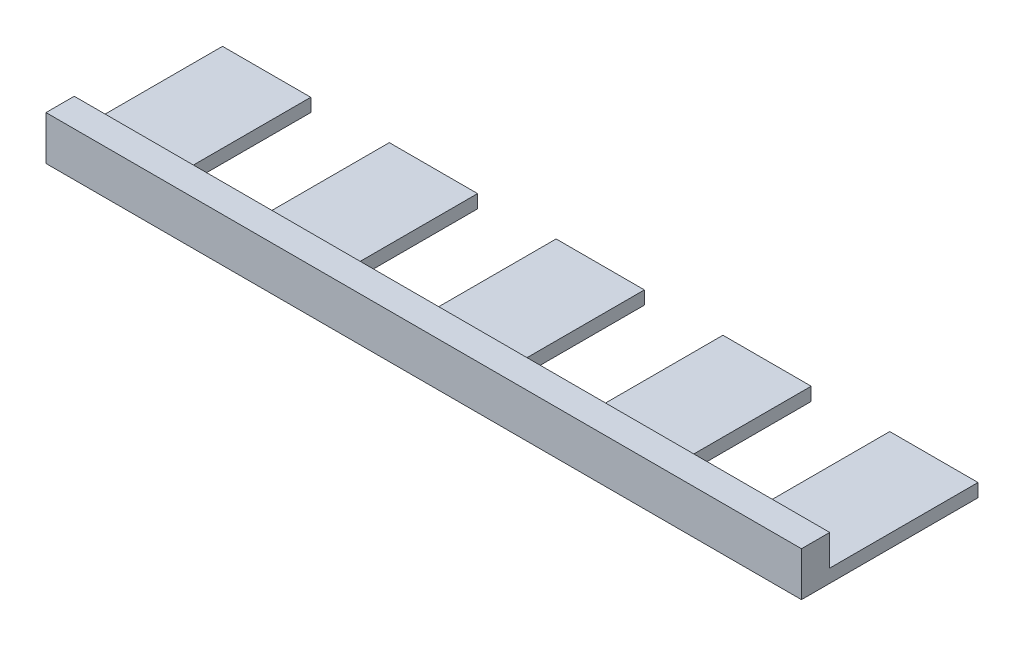
ISO-10303-21;
HEADER;
FILE_DESCRIPTION(('STEP AP214'),'2;1');
FILE_NAME('part.step','',(''),(''),'','','');
FILE_SCHEMA(('AUTOMOTIVE_DESIGN { 1 0 10303 214 1 1 1 1 }'));
ENDSEC;
DATA;
#1=APPLICATION_CONTEXT('core data for automotive mechanical design processes');
#2=APPLICATION_PROTOCOL_DEFINITION('international standard','automotive_design',2000,#1);
#3=PRODUCT_CONTEXT('',#1,'mechanical');
#4=PRODUCT('Part','Part','',(#3));
#5=PRODUCT_RELATED_PRODUCT_CATEGORY('part','',(#4));
#6=PRODUCT_DEFINITION_FORMATION('','',#4);
#7=PRODUCT_DEFINITION_CONTEXT('part definition',#1,'design');
#8=PRODUCT_DEFINITION('design','',#6,#7);
#9=PRODUCT_DEFINITION_SHAPE('','',#8);
#10=(LENGTH_UNIT() NAMED_UNIT(*) SI_UNIT(.MILLI.,.METRE.));
#11=(NAMED_UNIT(*) PLANE_ANGLE_UNIT() SI_UNIT($,.RADIAN.));
#12=(NAMED_UNIT(*) SI_UNIT($,.STERADIAN.) SOLID_ANGLE_UNIT());
#13=UNCERTAINTY_MEASURE_WITH_UNIT(LENGTH_MEASURE(1.E-05),#10,'distance_accuracy_value','');
#14=(GEOMETRIC_REPRESENTATION_CONTEXT(3) GLOBAL_UNCERTAINTY_ASSIGNED_CONTEXT((#13)) GLOBAL_UNIT_ASSIGNED_CONTEXT((#10,
#11,#12)) REPRESENTATION_CONTEXT('',''));
#15=CARTESIAN_POINT('',(0.,0.,0.));
#16=DIRECTION('',(0.,0.,1.));
#17=DIRECTION('',(1.,0.,0.));
#18=AXIS2_PLACEMENT_3D('',#15,#16,#17);
#19=CARTESIAN_POINT('',(0.,3.,0.));
#20=DIRECTION('',(0.,1.,0.));
#21=DIRECTION('',(0.,0.,1.));
#22=AXIS2_PLACEMENT_3D('',#19,#20,#21);
#23=PLANE('',#22);
#24=DIRECTION('',(-1.,0.,0.));
#25=VECTOR('',#24,1.);
#26=CARTESIAN_POINT('',(0.,3.,-6.39999999999999));
#27=LINE('',#26,#25);
#28=CARTESIAN_POINT('',(171.2,3.,-6.39999999999999));
#29=VERTEX_POINT('',#28);
#30=CARTESIAN_POINT('',(151.2,3.,-6.40000000000001));
#31=VERTEX_POINT('',#30);
#32=EDGE_CURVE('E47',#29,#31,#27,.T.);
#33=ORIENTED_EDGE('',*,*,#32,.F.);
#34=DIRECTION('',(0.,0.,-1.));
#35=VECTOR('',#34,1.);
#36=CARTESIAN_POINT('',(171.2,3.,0.));
#37=LINE('',#36,#35);
#38=CARTESIAN_POINT('',(171.2,3.,-40.));
#39=VERTEX_POINT('',#38);
#40=EDGE_CURVE('E134',#29,#39,#37,.T.);
#41=ORIENTED_EDGE('',*,*,#40,.T.);
#42=DIRECTION('',(-1.,0.,0.));
#43=VECTOR('',#42,1.);
#44=CARTESIAN_POINT('',(0.,3.,-40.));
#45=LINE('',#44,#43);
#46=CARTESIAN_POINT('',(151.2,3.,-40.));
#47=VERTEX_POINT('',#46);
#48=EDGE_CURVE('E402',#39,#47,#45,.T.);
#49=ORIENTED_EDGE('',*,*,#48,.T.);
#50=DIRECTION('',(0.,0.,1.));
#51=VECTOR('',#50,1.);
#52=CARTESIAN_POINT('',(151.2,3.,0.));
#53=LINE('',#52,#51);
#54=EDGE_CURVE('E424',#47,#31,#53,.T.);
#55=ORIENTED_EDGE('',*,*,#54,.T.);
#56=EDGE_LOOP('',(#33,#41,#49,#55));
#57=FACE_BOUND('',#56,.T.);
#58=ADVANCED_FACE('F36',(#57),#23,.T.);
#59=CARTESIAN_POINT('',(133.4,3.,-6.40000000000001));
#60=VERTEX_POINT('',#59);
#61=CARTESIAN_POINT('',(113.4,3.,-6.4));
#62=VERTEX_POINT('',#61);
#63=EDGE_CURVE('E11',#60,#62,#27,.T.);
#64=ORIENTED_EDGE('',*,*,#63,.F.);
#65=DIRECTION('',(0.,0.,-1.));
#66=VECTOR('',#65,1.);
#67=CARTESIAN_POINT('',(133.4,3.,0.));
#68=LINE('',#67,#66);
#69=CARTESIAN_POINT('',(133.4,3.,-40.));
#70=VERTEX_POINT('',#69);
#71=EDGE_CURVE('E426',#60,#70,#68,.T.);
#72=ORIENTED_EDGE('',*,*,#71,.T.);
#73=DIRECTION('',(-1.,0.,0.));
#74=VECTOR('',#73,1.);
#75=CARTESIAN_POINT('',(0.,3.,-40.));
#76=LINE('',#75,#74);
#77=CARTESIAN_POINT('',(113.4,3.,-40.));
#78=VERTEX_POINT('',#77);
#79=EDGE_CURVE('E428',#70,#78,#76,.T.);
#80=ORIENTED_EDGE('',*,*,#79,.T.);
#81=DIRECTION('',(0.,0.,1.));
#82=VECTOR('',#81,1.);
#83=CARTESIAN_POINT('',(113.4,3.,0.));
#84=LINE('',#83,#82);
#85=EDGE_CURVE('E430',#78,#62,#84,.T.);
#86=ORIENTED_EDGE('',*,*,#85,.T.);
#87=EDGE_LOOP('',(#64,#72,#80,#86));
#88=FACE_BOUND('',#87,.T.);
#89=ADVANCED_FACE('F330',(#88),#23,.T.);
#90=CARTESIAN_POINT('',(95.6,3.,-6.4));
#91=VERTEX_POINT('',#90);
#92=CARTESIAN_POINT('',(75.6,3.,-6.4));
#93=VERTEX_POINT('',#92);
#94=EDGE_CURVE('E45',#91,#93,#27,.T.);
#95=ORIENTED_EDGE('',*,*,#94,.F.);
#96=DIRECTION('',(0.,0.,-1.));
#97=VECTOR('',#96,1.);
#98=CARTESIAN_POINT('',(95.6,3.,0.));
#99=LINE('',#98,#97);
#100=CARTESIAN_POINT('',(95.6,3.,-40.));
#101=VERTEX_POINT('',#100);
#102=EDGE_CURVE('E432',#91,#101,#99,.T.);
#103=ORIENTED_EDGE('',*,*,#102,.T.);
#104=DIRECTION('',(1.,0.,0.));
#105=VECTOR('',#104,1.);
#106=CARTESIAN_POINT('',(0.,3.,-40.));
#107=LINE('',#106,#105);
#108=CARTESIAN_POINT('',(75.6,3.,-40.));
#109=VERTEX_POINT('',#108);
#110=EDGE_CURVE('E434',#109,#101,#107,.T.);
#111=ORIENTED_EDGE('',*,*,#110,.F.);
#112=DIRECTION('',(0.,0.,-1.));
#113=VECTOR('',#112,1.);
#114=CARTESIAN_POINT('',(75.6,3.,0.));
#115=LINE('',#114,#113);
#116=EDGE_CURVE('E437',#93,#109,#115,.T.);
#117=ORIENTED_EDGE('',*,*,#116,.F.);
#118=EDGE_LOOP('',(#95,#103,#111,#117));
#119=FACE_BOUND('',#118,.T.);
#120=ADVANCED_FACE('F326',(#119),#23,.T.);
#121=CARTESIAN_POINT('',(57.8,3.,-6.4));
#122=VERTEX_POINT('',#121);
#123=CARTESIAN_POINT('',(37.8,3.,-6.4));
#124=VERTEX_POINT('',#123);
#125=EDGE_CURVE('E191',#122,#124,#27,.T.);
#126=ORIENTED_EDGE('',*,*,#125,.F.);
#127=DIRECTION('',(0.,0.,1.));
#128=VECTOR('',#127,1.);
#129=CARTESIAN_POINT('',(57.8,3.,0.));
#130=LINE('',#129,#128);
#131=CARTESIAN_POINT('',(57.8,3.,-40.));
#132=VERTEX_POINT('',#131);
#133=EDGE_CURVE('E440',#132,#122,#130,.T.);
#134=ORIENTED_EDGE('',*,*,#133,.F.);
#135=DIRECTION('',(1.,0.,0.));
#136=VECTOR('',#135,1.);
#137=CARTESIAN_POINT('',(0.,3.,-40.));
#138=LINE('',#137,#136);
#139=CARTESIAN_POINT('',(37.8,3.,-40.));
#140=VERTEX_POINT('',#139);
#141=EDGE_CURVE('E209',#140,#132,#138,.T.);
#142=ORIENTED_EDGE('',*,*,#141,.F.);
#143=DIRECTION('',(0.,0.,-1.));
#144=VECTOR('',#143,1.);
#145=CARTESIAN_POINT('',(37.8,3.,0.));
#146=LINE('',#145,#144);
#147=EDGE_CURVE('E205',#124,#140,#146,.T.);
#148=ORIENTED_EDGE('',*,*,#147,.F.);
#149=EDGE_LOOP('',(#126,#134,#142,#148));
#150=FACE_BOUND('',#149,.T.);
#151=ADVANCED_FACE('F320',(#150),#23,.T.);
#152=CARTESIAN_POINT('',(0.,3.,0.));
#153=DIRECTION('',(-1.,0.,0.));
#154=DIRECTION('',(0.,0.,1.));
#155=AXIS2_PLACEMENT_3D('',#152,#153,#154);
#156=PLANE('',#155);
#157=DIRECTION('',(0.,0.,-1.));
#158=VECTOR('',#157,1.);
#159=CARTESIAN_POINT('',(0.,0.,0.));
#160=LINE('',#159,#158);
#161=CARTESIAN_POINT('',(0.,0.,0.));
#162=VERTEX_POINT('',#161);
#163=CARTESIAN_POINT('',(0.,0.,-40.));
#164=VERTEX_POINT('',#163);
#165=EDGE_CURVE('E213',#162,#164,#160,.T.);
#166=ORIENTED_EDGE('',*,*,#165,.F.);
#167=DIRECTION('',(0.,-1.,0.));
#168=VECTOR('',#167,1.);
#169=CARTESIAN_POINT('',(0.,3.,0.));
#170=LINE('',#169,#168);
#171=CARTESIAN_POINT('',(0.,10.,0.));
#172=VERTEX_POINT('',#171);
#173=EDGE_CURVE('E40',#172,#162,#170,.T.);
#174=ORIENTED_EDGE('',*,*,#173,.F.);
#175=DIRECTION('',(0.,0.,1.));
#176=VECTOR('',#175,1.);
#177=CARTESIAN_POINT('',(0.,10.,-6.39999999999999));
#178=LINE('',#177,#176);
#179=CARTESIAN_POINT('',(0.,10.,-6.39999999999999));
#180=VERTEX_POINT('',#179);
#181=EDGE_CURVE('E412',#180,#172,#178,.T.);
#182=ORIENTED_EDGE('',*,*,#181,.F.);
#183=DIRECTION('',(0.,-1.,0.));
#184=VECTOR('',#183,1.);
#185=CARTESIAN_POINT('',(0.,10.,-6.39999999999999));
#186=LINE('',#185,#184);
#187=CARTESIAN_POINT('',(0.,3.,-6.39999999999999));
#188=VERTEX_POINT('',#187);
#189=EDGE_CURVE('E418',#180,#188,#186,.T.);
#190=ORIENTED_EDGE('',*,*,#189,.T.);
#191=DIRECTION('',(0.,0.,-1.));
#192=VECTOR('',#191,1.);
#193=CARTESIAN_POINT('',(0.,3.,0.));
#194=LINE('',#193,#192);
#195=CARTESIAN_POINT('',(0.,3.,-40.));
#196=VERTEX_POINT('',#195);
#197=EDGE_CURVE('E62',#188,#196,#194,.T.);
#198=ORIENTED_EDGE('',*,*,#197,.T.);
#199=DIRECTION('',(0.,-1.,0.));
#200=VECTOR('',#199,1.);
#201=CARTESIAN_POINT('',(0.,3.,-40.));
#202=LINE('',#201,#200);
#203=EDGE_CURVE('E129',#196,#164,#202,.T.);
#204=ORIENTED_EDGE('',*,*,#203,.T.);
#205=EDGE_LOOP('',(#166,#174,#182,#190,#198,#204));
#206=FACE_BOUND('',#205,.T.);
#207=ADVANCED_FACE('F38',(#206),#156,.T.);
#208=CARTESIAN_POINT('',(0.,3.,0.));
#209=DIRECTION('',(0.,0.,-1.));
#210=DIRECTION('',(-1.,0.,0.));
#211=AXIS2_PLACEMENT_3D('',#208,#209,#210);
#212=PLANE('',#211);
#213=DIRECTION('',(1.,0.,0.));
#214=VECTOR('',#213,1.);
#215=CARTESIAN_POINT('',(0.,0.,0.));
#216=LINE('',#215,#214);
#217=CARTESIAN_POINT('',(171.2,0.,0.));
#218=VERTEX_POINT('',#217);
#219=EDGE_CURVE('E215',#162,#218,#216,.T.);
#220=ORIENTED_EDGE('',*,*,#219,.T.);
#221=DIRECTION('',(0.,-1.,0.));
#222=VECTOR('',#221,1.);
#223=CARTESIAN_POINT('',(171.2,3.,0.));
#224=LINE('',#223,#222);
#225=CARTESIAN_POINT('',(171.2,10.,0.));
#226=VERTEX_POINT('',#225);
#227=EDGE_CURVE('E299',#226,#218,#224,.T.);
#228=ORIENTED_EDGE('',*,*,#227,.F.);
#229=DIRECTION('',(1.,0.,0.));
#230=VECTOR('',#229,1.);
#231=CARTESIAN_POINT('',(0.,10.,0.));
#232=LINE('',#231,#230);
#233=EDGE_CURVE('E312',#172,#226,#232,.T.);
#234=ORIENTED_EDGE('',*,*,#233,.F.);
#235=ORIENTED_EDGE('',*,*,#173,.T.);
#236=EDGE_LOOP('',(#220,#228,#234,#235));
#237=FACE_BOUND('',#236,.T.);
#238=ADVANCED_FACE('F309',(#237),#212,.F.);
#239=CARTESIAN_POINT('',(171.2,3.,0.));
#240=DIRECTION('',(-1.,0.,0.));
#241=DIRECTION('',(0.,0.,1.));
#242=AXIS2_PLACEMENT_3D('',#239,#240,#241);
#243=PLANE('',#242);
#244=DIRECTION('',(0.,0.,-1.));
#245=VECTOR('',#244,1.);
#246=CARTESIAN_POINT('',(171.2,0.,0.));
#247=LINE('',#246,#245);
#248=CARTESIAN_POINT('',(171.2,0.,-40.));
#249=VERTEX_POINT('',#248);
#250=EDGE_CURVE('E218',#218,#249,#247,.T.);
#251=ORIENTED_EDGE('',*,*,#250,.T.);
#252=DIRECTION('',(0.,-1.,0.));
#253=VECTOR('',#252,1.);
#254=CARTESIAN_POINT('',(171.2,3.,-40.));
#255=LINE('',#254,#253);
#256=EDGE_CURVE('E297',#39,#249,#255,.T.);
#257=ORIENTED_EDGE('',*,*,#256,.F.);
#258=ORIENTED_EDGE('',*,*,#40,.F.);
#259=DIRECTION('',(0.,-1.,0.));
#260=VECTOR('',#259,1.);
#261=CARTESIAN_POINT('',(171.2,10.,-6.39999999999999));
#262=LINE('',#261,#260);
#263=CARTESIAN_POINT('',(171.2,10.,-6.39999999999999));
#264=VERTEX_POINT('',#263);
#265=EDGE_CURVE('E216',#264,#29,#262,.T.);
#266=ORIENTED_EDGE('',*,*,#265,.F.);
#267=DIRECTION('',(0.,0.,-1.));
#268=VECTOR('',#267,1.);
#269=CARTESIAN_POINT('',(171.2,10.,-6.39999999999999));
#270=LINE('',#269,#268);
#271=EDGE_CURVE('E657',#226,#264,#270,.T.);
#272=ORIENTED_EDGE('',*,*,#271,.F.);
#273=ORIENTED_EDGE('',*,*,#227,.T.);
#274=EDGE_LOOP('',(#251,#257,#258,#266,#272,#273));
#275=FACE_BOUND('',#274,.T.);
#276=ADVANCED_FACE('F325',(#275),#243,.F.);
#277=CARTESIAN_POINT('',(0.,3.,-40.));
#278=DIRECTION('',(0.,0.,1.));
#279=DIRECTION('',(1.,0.,0.));
#280=AXIS2_PLACEMENT_3D('',#277,#278,#279);
#281=PLANE('',#280);
#282=DIRECTION('',(-1.,0.,0.));
#283=VECTOR('',#282,1.);
#284=CARTESIAN_POINT('',(0.,0.,-40.));
#285=LINE('',#284,#283);
#286=CARTESIAN_POINT('',(151.2,0.,-40.));
#287=VERTEX_POINT('',#286);
#288=EDGE_CURVE('E220',#249,#287,#285,.T.);
#289=ORIENTED_EDGE('',*,*,#288,.T.);
#290=DIRECTION('',(0.,-1.,0.));
#291=VECTOR('',#290,1.);
#292=CARTESIAN_POINT('',(151.2,3.,-40.));
#293=LINE('',#292,#291);
#294=EDGE_CURVE('E294',#47,#287,#293,.T.);
#295=ORIENTED_EDGE('',*,*,#294,.F.);
#296=ORIENTED_EDGE('',*,*,#48,.F.);
#297=ORIENTED_EDGE('',*,*,#256,.T.);
#298=EDGE_LOOP('',(#289,#295,#296,#297));
#299=FACE_BOUND('',#298,.T.);
#300=ADVANCED_FACE('F392',(#299),#281,.F.);
#301=CARTESIAN_POINT('',(151.2,3.,0.));
#302=DIRECTION('',(1.,0.,0.));
#303=DIRECTION('',(0.,0.,-1.));
#304=AXIS2_PLACEMENT_3D('',#301,#302,#303);
#305=PLANE('',#304);
#306=DIRECTION('',(0.,0.,1.));
#307=VECTOR('',#306,1.);
#308=CARTESIAN_POINT('',(151.2,0.,0.));
#309=LINE('',#308,#307);
#310=CARTESIAN_POINT('',(151.2,0.,-6.40000000000001));
#311=VERTEX_POINT('',#310);
#312=EDGE_CURVE('E222',#287,#311,#309,.T.);
#313=ORIENTED_EDGE('',*,*,#312,.T.);
#314=DIRECTION('',(0.,-1.,0.));
#315=VECTOR('',#314,1.);
#316=CARTESIAN_POINT('',(151.2,3.,-6.40000000000001));
#317=LINE('',#316,#315);
#318=EDGE_CURVE('E291',#31,#311,#317,.T.);
#319=ORIENTED_EDGE('',*,*,#318,.F.);
#320=ORIENTED_EDGE('',*,*,#54,.F.);
#321=ORIENTED_EDGE('',*,*,#294,.T.);
#322=EDGE_LOOP('',(#313,#319,#320,#321));
#323=FACE_BOUND('',#322,.T.);
#324=ADVANCED_FACE('F388',(#323),#305,.F.);
#325=CARTESIAN_POINT('',(133.4,3.,0.));
#326=DIRECTION('',(-1.,0.,0.));
#327=DIRECTION('',(0.,0.,1.));
#328=AXIS2_PLACEMENT_3D('',#325,#326,#327);
#329=PLANE('',#328);
#330=DIRECTION('',(0.,0.,-1.));
#331=VECTOR('',#330,1.);
#332=CARTESIAN_POINT('',(133.4,0.,0.));
#333=LINE('',#332,#331);
#334=CARTESIAN_POINT('',(133.4,0.,-6.40000000000001));
#335=VERTEX_POINT('',#334);
#336=CARTESIAN_POINT('',(133.4,0.,-40.));
#337=VERTEX_POINT('',#336);
#338=EDGE_CURVE('E226',#335,#337,#333,.T.);
#339=ORIENTED_EDGE('',*,*,#338,.T.);
#340=DIRECTION('',(0.,-1.,0.));
#341=VECTOR('',#340,1.);
#342=CARTESIAN_POINT('',(133.4,3.,-40.));
#343=LINE('',#342,#341);
#344=EDGE_CURVE('E285',#70,#337,#343,.T.);
#345=ORIENTED_EDGE('',*,*,#344,.F.);
#346=ORIENTED_EDGE('',*,*,#71,.F.);
#347=DIRECTION('',(0.,-1.,0.));
#348=VECTOR('',#347,1.);
#349=CARTESIAN_POINT('',(133.4,3.,-6.40000000000001));
#350=LINE('',#349,#348);
#351=EDGE_CURVE('E288',#60,#335,#350,.T.);
#352=ORIENTED_EDGE('',*,*,#351,.T.);
#353=EDGE_LOOP('',(#339,#345,#346,#352));
#354=FACE_BOUND('',#353,.T.);
#355=ADVANCED_FACE('F384',(#354),#329,.F.);
#356=CARTESIAN_POINT('',(0.,3.,-40.));
#357=DIRECTION('',(0.,0.,1.));
#358=DIRECTION('',(1.,0.,0.));
#359=AXIS2_PLACEMENT_3D('',#356,#357,#358);
#360=PLANE('',#359);
#361=DIRECTION('',(-1.,0.,0.));
#362=VECTOR('',#361,1.);
#363=CARTESIAN_POINT('',(0.,0.,-40.));
#364=LINE('',#363,#362);
#365=CARTESIAN_POINT('',(113.4,0.,-40.));
#366=VERTEX_POINT('',#365);
#367=EDGE_CURVE('E228',#337,#366,#364,.T.);
#368=ORIENTED_EDGE('',*,*,#367,.T.);
#369=DIRECTION('',(0.,-1.,0.));
#370=VECTOR('',#369,1.);
#371=CARTESIAN_POINT('',(113.4,3.,-40.));
#372=LINE('',#371,#370);
#373=EDGE_CURVE('E282',#78,#366,#372,.T.);
#374=ORIENTED_EDGE('',*,*,#373,.F.);
#375=ORIENTED_EDGE('',*,*,#79,.F.);
#376=ORIENTED_EDGE('',*,*,#344,.T.);
#377=EDGE_LOOP('',(#368,#374,#375,#376));
#378=FACE_BOUND('',#377,.T.);
#379=ADVANCED_FACE('F380',(#378),#360,.F.);
#380=CARTESIAN_POINT('',(113.4,3.,0.));
#381=DIRECTION('',(1.,0.,0.));
#382=DIRECTION('',(0.,0.,-1.));
#383=AXIS2_PLACEMENT_3D('',#380,#381,#382);
#384=PLANE('',#383);
#385=DIRECTION('',(0.,0.,1.));
#386=VECTOR('',#385,1.);
#387=CARTESIAN_POINT('',(113.4,0.,0.));
#388=LINE('',#387,#386);
#389=CARTESIAN_POINT('',(113.4,0.,-6.4));
#390=VERTEX_POINT('',#389);
#391=EDGE_CURVE('E230',#366,#390,#388,.T.);
#392=ORIENTED_EDGE('',*,*,#391,.T.);
#393=DIRECTION('',(0.,-1.,0.));
#394=VECTOR('',#393,1.);
#395=CARTESIAN_POINT('',(113.4,3.,-6.4));
#396=LINE('',#395,#394);
#397=EDGE_CURVE('E279',#62,#390,#396,.T.);
#398=ORIENTED_EDGE('',*,*,#397,.F.);
#399=ORIENTED_EDGE('',*,*,#85,.F.);
#400=ORIENTED_EDGE('',*,*,#373,.T.);
#401=EDGE_LOOP('',(#392,#398,#399,#400));
#402=FACE_BOUND('',#401,.T.);
#403=ADVANCED_FACE('F376',(#402),#384,.F.);
#404=CARTESIAN_POINT('',(95.6,3.,0.));
#405=DIRECTION('',(-1.,0.,0.));
#406=DIRECTION('',(0.,0.,1.));
#407=AXIS2_PLACEMENT_3D('',#404,#405,#406);
#408=PLANE('',#407);
#409=DIRECTION('',(0.,0.,-1.));
#410=VECTOR('',#409,1.);
#411=CARTESIAN_POINT('',(95.6,0.,0.));
#412=LINE('',#411,#410);
#413=CARTESIAN_POINT('',(95.6,0.,-6.4));
#414=VERTEX_POINT('',#413);
#415=CARTESIAN_POINT('',(95.6,0.,-40.));
#416=VERTEX_POINT('',#415);
#417=EDGE_CURVE('E234',#414,#416,#412,.T.);
#418=ORIENTED_EDGE('',*,*,#417,.T.);
#419=DIRECTION('',(0.,-1.,0.));
#420=VECTOR('',#419,1.);
#421=CARTESIAN_POINT('',(95.6,3.,-40.));
#422=LINE('',#421,#420);
#423=EDGE_CURVE('E274',#101,#416,#422,.T.);
#424=ORIENTED_EDGE('',*,*,#423,.F.);
#425=ORIENTED_EDGE('',*,*,#102,.F.);
#426=DIRECTION('',(0.,-1.,0.));
#427=VECTOR('',#426,1.);
#428=CARTESIAN_POINT('',(95.6,3.,-6.4));
#429=LINE('',#428,#427);
#430=EDGE_CURVE('E276',#91,#414,#429,.T.);
#431=ORIENTED_EDGE('',*,*,#430,.T.);
#432=EDGE_LOOP('',(#418,#424,#425,#431));
#433=FACE_BOUND('',#432,.T.);
#434=ADVANCED_FACE('F372',(#433),#408,.F.);
#435=CARTESIAN_POINT('',(0.,3.,-40.));
#436=DIRECTION('',(0.,0.,-1.));
#437=DIRECTION('',(-1.,0.,0.));
#438=AXIS2_PLACEMENT_3D('',#435,#436,#437);
#439=PLANE('',#438);
#440=DIRECTION('',(1.,0.,0.));
#441=VECTOR('',#440,1.);
#442=CARTESIAN_POINT('',(0.,0.,-40.));
#443=LINE('',#442,#441);
#444=CARTESIAN_POINT('',(75.6,0.,-40.));
#445=VERTEX_POINT('',#444);
#446=EDGE_CURVE('E237',#445,#416,#443,.T.);
#447=ORIENTED_EDGE('',*,*,#446,.F.);
#448=DIRECTION('',(0.,-1.,0.));
#449=VECTOR('',#448,1.);
#450=CARTESIAN_POINT('',(75.6,3.,-40.));
#451=LINE('',#450,#449);
#452=EDGE_CURVE('E272',#109,#445,#451,.T.);
#453=ORIENTED_EDGE('',*,*,#452,.F.);
#454=ORIENTED_EDGE('',*,*,#110,.T.);
#455=ORIENTED_EDGE('',*,*,#423,.T.);
#456=EDGE_LOOP('',(#447,#453,#454,#455));
#457=FACE_BOUND('',#456,.T.);
#458=ADVANCED_FACE('F368',(#457),#439,.T.);
#459=CARTESIAN_POINT('',(75.6,3.,0.));
#460=DIRECTION('',(-1.,0.,0.));
#461=DIRECTION('',(0.,0.,1.));
#462=AXIS2_PLACEMENT_3D('',#459,#460,#461);
#463=PLANE('',#462);
#464=DIRECTION('',(0.,0.,-1.));
#465=VECTOR('',#464,1.);
#466=CARTESIAN_POINT('',(75.6,0.,0.));
#467=LINE('',#466,#465);
#468=CARTESIAN_POINT('',(75.6,0.,-6.4));
#469=VERTEX_POINT('',#468);
#470=EDGE_CURVE('E240',#469,#445,#467,.T.);
#471=ORIENTED_EDGE('',*,*,#470,.F.);
#472=DIRECTION('',(0.,-1.,0.));
#473=VECTOR('',#472,1.);
#474=CARTESIAN_POINT('',(75.6,3.,-6.4));
#475=LINE('',#474,#473);
#476=EDGE_CURVE('E270',#93,#469,#475,.T.);
#477=ORIENTED_EDGE('',*,*,#476,.F.);
#478=ORIENTED_EDGE('',*,*,#116,.T.);
#479=ORIENTED_EDGE('',*,*,#452,.T.);
#480=EDGE_LOOP('',(#471,#477,#478,#479));
#481=FACE_BOUND('',#480,.T.);
#482=ADVANCED_FACE('F364',(#481),#463,.T.);
#483=CARTESIAN_POINT('',(57.8,3.,0.));
#484=DIRECTION('',(1.,0.,0.));
#485=DIRECTION('',(0.,0.,-1.));
#486=AXIS2_PLACEMENT_3D('',#483,#484,#485);
#487=PLANE('',#486);
#488=DIRECTION('',(0.,0.,1.));
#489=VECTOR('',#488,1.);
#490=CARTESIAN_POINT('',(57.8,0.,0.));
#491=LINE('',#490,#489);
#492=CARTESIAN_POINT('',(57.8,0.,-40.));
#493=VERTEX_POINT('',#492);
#494=CARTESIAN_POINT('',(57.8,0.,-6.4));
#495=VERTEX_POINT('',#494);
#496=EDGE_CURVE('E246',#493,#495,#491,.T.);
#497=ORIENTED_EDGE('',*,*,#496,.F.);
#498=DIRECTION('',(0.,-1.,0.));
#499=VECTOR('',#498,1.);
#500=CARTESIAN_POINT('',(57.8,3.,-40.));
#501=LINE('',#500,#499);
#502=EDGE_CURVE('E266',#132,#493,#501,.T.);
#503=ORIENTED_EDGE('',*,*,#502,.F.);
#504=ORIENTED_EDGE('',*,*,#133,.T.);
#505=DIRECTION('',(0.,-1.,0.));
#506=VECTOR('',#505,1.);
#507=CARTESIAN_POINT('',(57.8,3.,-6.4));
#508=LINE('',#507,#506);
#509=EDGE_CURVE('E268',#122,#495,#508,.T.);
#510=ORIENTED_EDGE('',*,*,#509,.T.);
#511=EDGE_LOOP('',(#497,#503,#504,#510));
#512=FACE_BOUND('',#511,.T.);
#513=ADVANCED_FACE('F360',(#512),#487,.T.);
#514=CARTESIAN_POINT('',(0.,3.,-40.));
#515=DIRECTION('',(0.,0.,-1.));
#516=DIRECTION('',(-1.,0.,0.));
#517=AXIS2_PLACEMENT_3D('',#514,#515,#516);
#518=PLANE('',#517);
#519=DIRECTION('',(1.,0.,0.));
#520=VECTOR('',#519,1.);
#521=CARTESIAN_POINT('',(0.,0.,-40.));
#522=LINE('',#521,#520);
#523=CARTESIAN_POINT('',(37.8,0.,-40.));
#524=VERTEX_POINT('',#523);
#525=EDGE_CURVE('E249',#524,#493,#522,.T.);
#526=ORIENTED_EDGE('',*,*,#525,.F.);
#527=DIRECTION('',(0.,-1.,0.));
#528=VECTOR('',#527,1.);
#529=CARTESIAN_POINT('',(37.8,3.,-40.));
#530=LINE('',#529,#528);
#531=EDGE_CURVE('E264',#140,#524,#530,.T.);
#532=ORIENTED_EDGE('',*,*,#531,.F.);
#533=ORIENTED_EDGE('',*,*,#141,.T.);
#534=ORIENTED_EDGE('',*,*,#502,.T.);
#535=EDGE_LOOP('',(#526,#532,#533,#534));
#536=FACE_BOUND('',#535,.T.);
#537=ADVANCED_FACE('F356',(#536),#518,.T.);
#538=CARTESIAN_POINT('',(37.8,3.,0.));
#539=DIRECTION('',(-1.,0.,0.));
#540=DIRECTION('',(0.,0.,1.));
#541=AXIS2_PLACEMENT_3D('',#538,#539,#540);
#542=PLANE('',#541);
#543=DIRECTION('',(0.,0.,-1.));
#544=VECTOR('',#543,1.);
#545=CARTESIAN_POINT('',(37.8,0.,0.));
#546=LINE('',#545,#544);
#547=CARTESIAN_POINT('',(37.8,0.,-6.4));
#548=VERTEX_POINT('',#547);
#549=EDGE_CURVE('E252',#548,#524,#546,.T.);
#550=ORIENTED_EDGE('',*,*,#549,.F.);
#551=DIRECTION('',(0.,-1.,0.));
#552=VECTOR('',#551,1.);
#553=CARTESIAN_POINT('',(37.8,3.,-6.4));
#554=LINE('',#553,#552);
#555=EDGE_CURVE('E200',#124,#548,#554,.T.);
#556=ORIENTED_EDGE('',*,*,#555,.F.);
#557=ORIENTED_EDGE('',*,*,#147,.T.);
#558=ORIENTED_EDGE('',*,*,#531,.T.);
#559=EDGE_LOOP('',(#550,#556,#557,#558));
#560=FACE_BOUND('',#559,.T.);
#561=ADVANCED_FACE('F353',(#560),#542,.T.);
#562=CARTESIAN_POINT('',(0.,3.,-6.4));
#563=DIRECTION('',(0.,0.,-1.));
#564=DIRECTION('',(-1.,0.,0.));
#565=AXIS2_PLACEMENT_3D('',#562,#563,#564);
#566=PLANE('',#565);
#567=DIRECTION('',(1.,0.,0.));
#568=VECTOR('',#567,1.);
#569=CARTESIAN_POINT('',(0.,0.,-6.4));
#570=LINE('',#569,#568);
#571=CARTESIAN_POINT('',(20.,0.,-6.4));
#572=VERTEX_POINT('',#571);
#573=EDGE_CURVE('E196',#572,#548,#570,.T.);
#574=ORIENTED_EDGE('',*,*,#573,.F.);
#575=DIRECTION('',(0.,-1.,0.));
#576=VECTOR('',#575,1.);
#577=CARTESIAN_POINT('',(20.,3.,-6.4));
#578=LINE('',#577,#576);
#579=CARTESIAN_POINT('',(20.,3.,-6.4));
#580=VERTEX_POINT('',#579);
#581=EDGE_CURVE('E193',#580,#572,#578,.T.);
#582=ORIENTED_EDGE('',*,*,#581,.F.);
#583=EDGE_CURVE('E182',#580,#188,#27,.T.);
#584=ORIENTED_EDGE('',*,*,#583,.T.);
#585=ORIENTED_EDGE('',*,*,#189,.F.);
#586=DIRECTION('',(-1.,0.,0.));
#587=VECTOR('',#586,1.);
#588=CARTESIAN_POINT('',(0.,10.,-6.39999999999999));
#589=LINE('',#588,#587);
#590=EDGE_CURVE('E416',#264,#180,#589,.T.);
#591=ORIENTED_EDGE('',*,*,#590,.F.);
#592=ORIENTED_EDGE('',*,*,#265,.T.);
#593=ORIENTED_EDGE('',*,*,#32,.T.);
#594=ORIENTED_EDGE('',*,*,#318,.T.);
#595=DIRECTION('',(-1.,0.,0.));
#596=VECTOR('',#595,1.);
#597=CARTESIAN_POINT('',(0.,0.,-6.39999999999997));
#598=LINE('',#597,#596);
#599=EDGE_CURVE('E224',#311,#335,#598,.T.);
#600=ORIENTED_EDGE('',*,*,#599,.T.);
#601=ORIENTED_EDGE('',*,*,#351,.F.);
#602=ORIENTED_EDGE('',*,*,#63,.T.);
#603=ORIENTED_EDGE('',*,*,#397,.T.);
#604=DIRECTION('',(-1.,0.,0.));
#605=VECTOR('',#604,1.);
#606=CARTESIAN_POINT('',(0.,0.,-6.39999999999998));
#607=LINE('',#606,#605);
#608=EDGE_CURVE('E232',#390,#414,#607,.T.);
#609=ORIENTED_EDGE('',*,*,#608,.T.);
#610=ORIENTED_EDGE('',*,*,#430,.F.);
#611=ORIENTED_EDGE('',*,*,#94,.T.);
#612=ORIENTED_EDGE('',*,*,#476,.T.);
#613=DIRECTION('',(1.,0.,0.));
#614=VECTOR('',#613,1.);
#615=CARTESIAN_POINT('',(0.,0.,-6.4));
#616=LINE('',#615,#614);
#617=EDGE_CURVE('E243',#495,#469,#616,.T.);
#618=ORIENTED_EDGE('',*,*,#617,.F.);
#619=ORIENTED_EDGE('',*,*,#509,.F.);
#620=ORIENTED_EDGE('',*,*,#125,.T.);
#621=ORIENTED_EDGE('',*,*,#555,.T.);
#622=EDGE_LOOP('',(#574,#582,#584,#585,#591,#592,#593,#594,#600,#601,#602,#603,#609,#610,#611,
#612,#618,#619,#620,#621));
#623=FACE_BOUND('',#622,.T.);
#624=ADVANCED_FACE('F194',(#623),#566,.T.);
#625=CARTESIAN_POINT('',(20.,3.,0.));
#626=DIRECTION('',(1.,0.,0.));
#627=DIRECTION('',(0.,0.,-1.));
#628=AXIS2_PLACEMENT_3D('',#625,#626,#627);
#629=PLANE('',#628);
#630=DIRECTION('',(0.,0.,1.));
#631=VECTOR('',#630,1.);
#632=CARTESIAN_POINT('',(20.,0.,0.));
#633=LINE('',#632,#631);
#634=CARTESIAN_POINT('',(20.,0.,-40.));
#635=VERTEX_POINT('',#634);
#636=EDGE_CURVE('E256',#635,#572,#633,.T.);
#637=ORIENTED_EDGE('',*,*,#636,.F.);
#638=DIRECTION('',(0.,-1.,0.));
#639=VECTOR('',#638,1.);
#640=CARTESIAN_POINT('',(20.,3.,-40.));
#641=LINE('',#640,#639);
#642=CARTESIAN_POINT('',(20.,3.,-40.));
#643=VERTEX_POINT('',#642);
#644=EDGE_CURVE('E201',#643,#635,#641,.T.);
#645=ORIENTED_EDGE('',*,*,#644,.F.);
#646=DIRECTION('',(0.,0.,1.));
#647=VECTOR('',#646,1.);
#648=CARTESIAN_POINT('',(20.,3.,0.));
#649=LINE('',#648,#647);
#650=EDGE_CURVE('E187',#643,#580,#649,.T.);
#651=ORIENTED_EDGE('',*,*,#650,.T.);
#652=ORIENTED_EDGE('',*,*,#581,.T.);
#653=EDGE_LOOP('',(#637,#645,#651,#652));
#654=FACE_BOUND('',#653,.T.);
#655=ADVANCED_FACE('F203',(#654),#629,.T.);
#656=CARTESIAN_POINT('',(0.,3.,-40.));
#657=DIRECTION('',(0.,0.,-1.));
#658=DIRECTION('',(-1.,0.,0.));
#659=AXIS2_PLACEMENT_3D('',#656,#657,#658);
#660=PLANE('',#659);
#661=DIRECTION('',(1.,0.,0.));
#662=VECTOR('',#661,1.);
#663=CARTESIAN_POINT('',(0.,0.,-40.));
#664=LINE('',#663,#662);
#665=EDGE_CURVE('E258',#164,#635,#664,.T.);
#666=ORIENTED_EDGE('',*,*,#665,.F.);
#667=ORIENTED_EDGE('',*,*,#203,.F.);
#668=DIRECTION('',(1.,0.,0.));
#669=VECTOR('',#668,1.);
#670=CARTESIAN_POINT('',(0.,3.,-40.));
#671=LINE('',#670,#669);
#672=EDGE_CURVE('E204',#196,#643,#671,.T.);
#673=ORIENTED_EDGE('',*,*,#672,.T.);
#674=ORIENTED_EDGE('',*,*,#644,.T.);
#675=EDGE_LOOP('',(#666,#667,#673,#674));
#676=FACE_BOUND('',#675,.T.);
#677=ADVANCED_FACE('F338',(#676),#660,.T.);
#678=ORIENTED_EDGE('',*,*,#583,.F.);
#679=ORIENTED_EDGE('',*,*,#650,.F.);
#680=ORIENTED_EDGE('',*,*,#672,.F.);
#681=ORIENTED_EDGE('',*,*,#197,.F.);
#682=EDGE_LOOP('',(#678,#679,#680,#681));
#683=FACE_BOUND('',#682,.T.);
#684=ADVANCED_FACE('F184',(#683),#23,.T.);
#685=CARTESIAN_POINT('',(0.,0.,0.));
#686=DIRECTION('',(0.,1.,0.));
#687=DIRECTION('',(0.,0.,1.));
#688=AXIS2_PLACEMENT_3D('',#685,#686,#687);
#689=PLANE('',#688);
#690=ORIENTED_EDGE('',*,*,#165,.T.);
#691=ORIENTED_EDGE('',*,*,#665,.T.);
#692=ORIENTED_EDGE('',*,*,#636,.T.);
#693=ORIENTED_EDGE('',*,*,#573,.T.);
#694=ORIENTED_EDGE('',*,*,#549,.T.);
#695=ORIENTED_EDGE('',*,*,#525,.T.);
#696=ORIENTED_EDGE('',*,*,#496,.T.);
#697=ORIENTED_EDGE('',*,*,#617,.T.);
#698=ORIENTED_EDGE('',*,*,#470,.T.);
#699=ORIENTED_EDGE('',*,*,#446,.T.);
#700=ORIENTED_EDGE('',*,*,#417,.F.);
#701=ORIENTED_EDGE('',*,*,#608,.F.);
#702=ORIENTED_EDGE('',*,*,#391,.F.);
#703=ORIENTED_EDGE('',*,*,#367,.F.);
#704=ORIENTED_EDGE('',*,*,#338,.F.);
#705=ORIENTED_EDGE('',*,*,#599,.F.);
#706=ORIENTED_EDGE('',*,*,#312,.F.);
#707=ORIENTED_EDGE('',*,*,#288,.F.);
#708=ORIENTED_EDGE('',*,*,#250,.F.);
#709=ORIENTED_EDGE('',*,*,#219,.F.);
#710=EDGE_LOOP('',(#690,#691,#692,#693,#694,#695,#696,#697,#698,#699,#700,#701,#702,#703,#704,
#705,#706,#707,#708,#709));
#711=FACE_BOUND('',#710,.T.);
#712=ADVANCED_FACE('F316',(#711),#689,.F.);
#713=CARTESIAN_POINT('',(0.,10.,0.));
#714=DIRECTION('',(0.,1.,0.));
#715=DIRECTION('',(0.,0.,1.));
#716=AXIS2_PLACEMENT_3D('',#713,#714,#715);
#717=PLANE('',#716);
#718=ORIENTED_EDGE('',*,*,#181,.T.);
#719=ORIENTED_EDGE('',*,*,#233,.T.);
#720=ORIENTED_EDGE('',*,*,#271,.T.);
#721=ORIENTED_EDGE('',*,*,#590,.T.);
#722=EDGE_LOOP('',(#718,#719,#720,#721));
#723=FACE_BOUND('',#722,.T.);
#724=ADVANCED_FACE('F343',(#723),#717,.T.);
#725=CLOSED_SHELL('',(#58,#89,#120,#151,#207,#238,#276,#300,#324,#355,#379,#403,#434,#458,#482,
#513,#537,#561,#624,#655,#677,#684,#712,#724));
#726=MANIFOLD_SOLID_BREP('B2',#725);
#727=ADVANCED_BREP_SHAPE_REPRESENTATION('',(#18,#726),#14);
#728=SHAPE_DEFINITION_REPRESENTATION(#9,#727);
ENDSEC;
END-ISO-10303-21;
